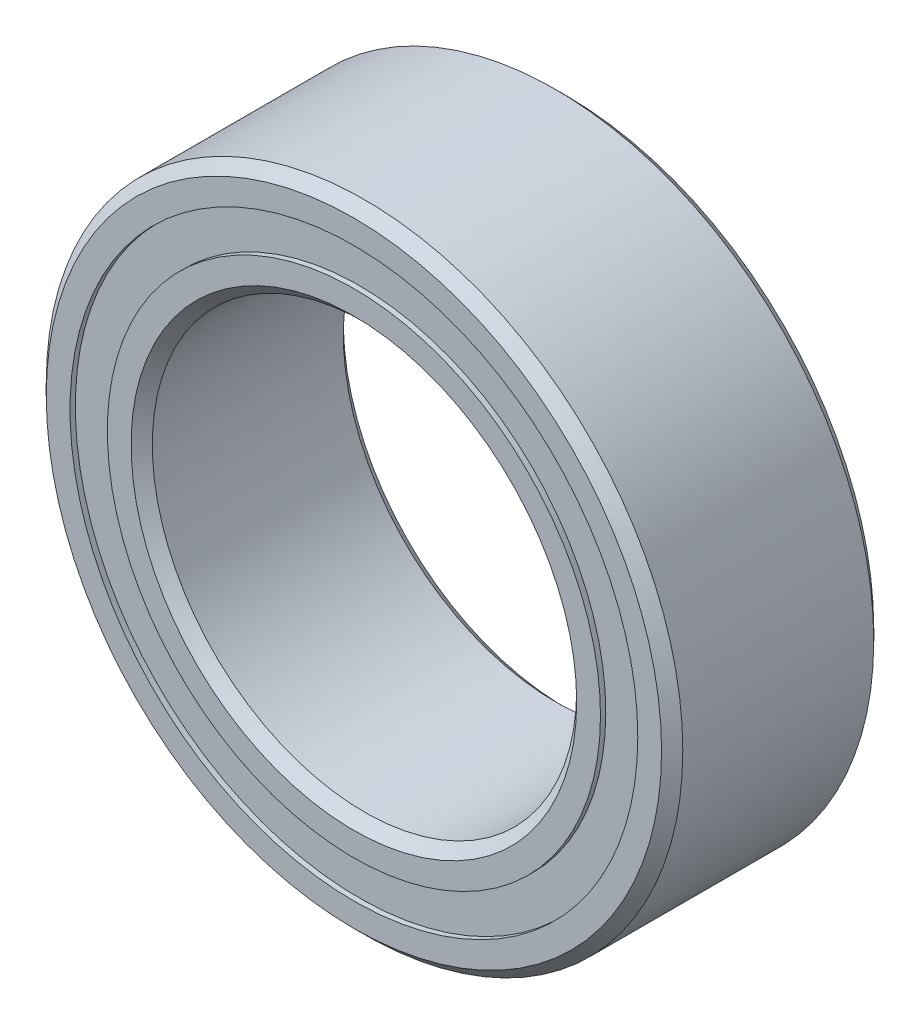
ISO-10303-21;
HEADER;
FILE_DESCRIPTION(('STEP AP214'),'2;1');
FILE_NAME('part.step','',(''),(''),'','','');
FILE_SCHEMA(('AUTOMOTIVE_DESIGN { 1 0 10303 214 1 1 1 1 }'));
ENDSEC;
DATA;
#1=APPLICATION_CONTEXT('core data for automotive mechanical design processes');
#2=APPLICATION_PROTOCOL_DEFINITION('international standard','automotive_design',2000,#1);
#3=PRODUCT_CONTEXT('',#1,'mechanical');
#4=PRODUCT('Part','Part','',(#3));
#5=PRODUCT_RELATED_PRODUCT_CATEGORY('part','',(#4));
#6=PRODUCT_DEFINITION_FORMATION('','',#4);
#7=PRODUCT_DEFINITION_CONTEXT('part definition',#1,'design');
#8=PRODUCT_DEFINITION('design','',#6,#7);
#9=PRODUCT_DEFINITION_SHAPE('','',#8);
#10=(LENGTH_UNIT() NAMED_UNIT(*) SI_UNIT(.MILLI.,.METRE.));
#11=(NAMED_UNIT(*) PLANE_ANGLE_UNIT() SI_UNIT($,.RADIAN.));
#12=(NAMED_UNIT(*) SI_UNIT($,.STERADIAN.) SOLID_ANGLE_UNIT());
#13=UNCERTAINTY_MEASURE_WITH_UNIT(LENGTH_MEASURE(1.E-05),#10,'distance_accuracy_value','');
#14=(GEOMETRIC_REPRESENTATION_CONTEXT(3) GLOBAL_UNCERTAINTY_ASSIGNED_CONTEXT((#13)) GLOBAL_UNIT_ASSIGNED_CONTEXT((#10,
#11,#12)) REPRESENTATION_CONTEXT('',''));
#15=CARTESIAN_POINT('',(0.,0.,0.));
#16=DIRECTION('',(0.,0.,1.));
#17=DIRECTION('',(1.,0.,0.));
#18=AXIS2_PLACEMENT_3D('',#15,#16,#17);
#19=CARTESIAN_POINT('',(-1.98437500000003,-3.43703832126947,0.));
#20=DIRECTION('',(-0.500000000000007,-0.866025403784435,0.));
#21=DIRECTION('',(0.,0.,-1.));
#22=AXIS2_PLACEMENT_3D('',#19,#20,#21);
#23=SPHERICAL_SURFACE('',#22,0.758760243513404);
#24=CARTESIAN_POINT('',(-2.36375512175674,-4.09414396753375,0.));
#25=VERTEX_POINT('',#24);
#26=VERTEX_LOOP('',#25);
#27=FACE_BOUND('',#26,.T.);
#28=CARTESIAN_POINT('',(-1.60499487824332,-2.7799326750052,0.));
#29=VERTEX_POINT('',#28);
#30=VERTEX_LOOP('',#29);
#31=FACE_BOUND('',#30,.T.);
#32=ADVANCED_FACE('P0_F16',(#27,#31),#23,.T.);
#33=CLOSED_SHELL('',(#32));
#34=MANIFOLD_SOLID_BREP('P0_B1',#33);
#35=CARTESIAN_POINT('',(-3.96875,0.,0.));
#36=DIRECTION('',(-1.,0.,0.));
#37=DIRECTION('',(0.,0.,-1.));
#38=AXIS2_PLACEMENT_3D('',#35,#36,#37);
#39=SPHERICAL_SURFACE('',#38,0.758760243513404);
#40=CARTESIAN_POINT('',(-4.7275102435134,0.,0.));
#41=VERTEX_POINT('',#40);
#42=VERTEX_LOOP('',#41);
#43=FACE_BOUND('',#42,.T.);
#44=CARTESIAN_POINT('',(-3.2099897564866,0.,0.));
#45=VERTEX_POINT('',#44);
#46=VERTEX_LOOP('',#45);
#47=FACE_BOUND('',#46,.T.);
#48=ADVANCED_FACE('P1_F16',(#43,#47),#39,.T.);
#49=CLOSED_SHELL('',(#48));
#50=MANIFOLD_SOLID_BREP('P1_B1',#49);
#51=CARTESIAN_POINT('',(3.43703832126948,-1.98437500000002,0.));
#52=DIRECTION('',(0.866025403784437,-0.500000000000004,0.));
#53=DIRECTION('',(0.,0.,-1.));
#54=AXIS2_PLACEMENT_3D('',#51,#52,#53);
#55=SPHERICAL_SURFACE('',#54,0.758760243513404);
#56=CARTESIAN_POINT('',(4.09414396753376,-2.36375512175672,0.));
#57=VERTEX_POINT('',#56);
#58=VERTEX_LOOP('',#57);
#59=FACE_BOUND('',#58,.T.);
#60=CARTESIAN_POINT('',(2.77993267500521,-1.60499487824331,0.));
#61=VERTEX_POINT('',#60);
#62=VERTEX_LOOP('',#61);
#63=FACE_BOUND('',#62,.T.);
#64=ADVANCED_FACE('P2_F17',(#59,#63),#55,.T.);
#65=CLOSED_SHELL('',(#64));
#66=MANIFOLD_SOLID_BREP('P2_B1',#65);
#67=CARTESIAN_POINT('',(1.98437499999998,-3.4370383212695,0.));
#68=DIRECTION('',(0.499999999999995,-0.866025403784442,0.));
#69=DIRECTION('',(0.,0.,-1.));
#70=AXIS2_PLACEMENT_3D('',#67,#68,#69);
#71=SPHERICAL_SURFACE('',#70,0.758760243513404);
#72=CARTESIAN_POINT('',(1.60499487824328,-2.77993267500523,0.));
#73=VERTEX_POINT('',#72);
#74=VERTEX_LOOP('',#73);
#75=FACE_BOUND('',#74,.T.);
#76=CARTESIAN_POINT('',(2.36375512175668,-4.09414396753378,0.));
#77=VERTEX_POINT('',#76);
#78=VERTEX_LOOP('',#77);
#79=FACE_BOUND('',#78,.T.);
#80=ADVANCED_FACE('P3_F16',(#75,#79),#71,.T.);
#81=CLOSED_SHELL('',(#80));
#82=MANIFOLD_SOLID_BREP('P3_B1',#81);
#83=CARTESIAN_POINT('',(1.984375,3.43703832126949,0.));
#84=DIRECTION('',(0.500000000000001,0.866025403784438,0.));
#85=DIRECTION('',(0.,0.,-1.));
#86=AXIS2_PLACEMENT_3D('',#83,#84,#85);
#87=SPHERICAL_SURFACE('',#86,0.758760243513404);
#88=CARTESIAN_POINT('',(2.36375512175671,4.09414396753376,0.));
#89=VERTEX_POINT('',#88);
#90=VERTEX_LOOP('',#89);
#91=FACE_BOUND('',#90,.T.);
#92=CARTESIAN_POINT('',(1.6049948782433,2.77993267500521,0.));
#93=VERTEX_POINT('',#92);
#94=VERTEX_LOOP('',#93);
#95=FACE_BOUND('',#94,.T.);
#96=ADVANCED_FACE('P4_F16',(#91,#95),#87,.T.);
#97=CLOSED_SHELL('',(#96));
#98=MANIFOLD_SOLID_BREP('P4_B1',#97);
#99=CARTESIAN_POINT('',(-1.98437499999996,3.43703832126952,0.));
#100=DIRECTION('',(-0.499999999999989,0.866025403784445,0.));
#101=DIRECTION('',(0.,0.,-1.));
#102=AXIS2_PLACEMENT_3D('',#99,#100,#101);
#103=SPHERICAL_SURFACE('',#102,0.758760243513404);
#104=CARTESIAN_POINT('',(-2.36375512175665,4.0941439675338,0.));
#105=VERTEX_POINT('',#104);
#106=VERTEX_LOOP('',#105);
#107=FACE_BOUND('',#106,.T.);
#108=CARTESIAN_POINT('',(-1.60499487824326,2.77993267500524,0.));
#109=VERTEX_POINT('',#108);
#110=VERTEX_LOOP('',#109);
#111=FACE_BOUND('',#110,.T.);
#112=ADVANCED_FACE('P5_F16',(#107,#111),#103,.T.);
#113=CLOSED_SHELL('',(#112));
#114=MANIFOLD_SOLID_BREP('P5_B1',#113);
#115=CARTESIAN_POINT('',(3.96875,0.,0.));
#116=DIRECTION('',(1.,0.,0.));
#117=DIRECTION('',(0.,0.,-1.));
#118=AXIS2_PLACEMENT_3D('',#115,#116,#117);
#119=SPHERICAL_SURFACE('',#118,0.758760243513404);
#120=CARTESIAN_POINT('',(3.2099897564866,0.,0.));
#121=VERTEX_POINT('',#120);
#122=VERTEX_LOOP('',#121);
#123=FACE_BOUND('',#122,.T.);
#124=CARTESIAN_POINT('',(4.7275102435134,0.,0.));
#125=VERTEX_POINT('',#124);
#126=VERTEX_LOOP('',#125);
#127=FACE_BOUND('',#126,.T.);
#128=ADVANCED_FACE('P6_F16',(#123,#127),#119,.T.);
#129=CLOSED_SHELL('',(#128));
#130=MANIFOLD_SOLID_BREP('P6_B1',#129);
#131=CARTESIAN_POINT('',(-3.43703832126947,1.98437500000004,0.));
#132=DIRECTION('',(-0.866025403784433,0.50000000000001,0.));
#133=DIRECTION('',(0.,0.,-1.));
#134=AXIS2_PLACEMENT_3D('',#131,#132,#133);
#135=SPHERICAL_SURFACE('',#134,0.758760243513404);
#136=CARTESIAN_POINT('',(-4.09414396753374,2.36375512175675,0.));
#137=VERTEX_POINT('',#136);
#138=VERTEX_LOOP('',#137);
#139=FACE_BOUND('',#138,.T.);
#140=CARTESIAN_POINT('',(-2.7799326750052,1.60499487824333,0.));
#141=VERTEX_POINT('',#140);
#142=VERTEX_LOOP('',#141);
#143=FACE_BOUND('',#142,.T.);
#144=ADVANCED_FACE('P7_F16',(#139,#143),#135,.T.);
#145=CLOSED_SHELL('',(#144));
#146=MANIFOLD_SOLID_BREP('P7_B1',#145);
#147=CARTESIAN_POINT('',(0.,4.24787087912088,-1.508125));
#148=DIRECTION('',(0.,0.,1.));
#149=DIRECTION('',(1.,0.,0.));
#150=AXIS2_PLACEMENT_3D('',#147,#148,#149);
#151=PLANE('',#150);
#152=CARTESIAN_POINT('',(0.,0.,-1.508125));
#153=DIRECTION('',(0.,0.,1.));
#154=DIRECTION('',(1.,0.,0.));
#155=AXIS2_PLACEMENT_3D('',#152,#153,#154);
#156=CIRCLE('',#155,3.68962912087912);
#157=CARTESIAN_POINT('',(3.68962912087912,0.,-1.508125));
#158=VERTEX_POINT('',#157);
#159=EDGE_CURVE('P8_E18',#158,#158,#156,.T.);
#160=ORIENTED_EDGE('',*,*,#159,.T.);
#161=EDGE_LOOP('',(#160));
#162=FACE_BOUND('',#161,.T.);
#163=CARTESIAN_POINT('',(0.,0.,-1.508125));
#164=DIRECTION('',(0.,0.,1.));
#165=DIRECTION('',(1.,0.,0.));
#166=AXIS2_PLACEMENT_3D('',#163,#164,#165);
#167=CIRCLE('',#166,4.24787087912088);
#168=CARTESIAN_POINT('',(4.24787087912088,0.,-1.508125));
#169=VERTEX_POINT('',#168);
#170=EDGE_CURVE('P8_E27',#169,#169,#167,.T.);
#171=ORIENTED_EDGE('',*,*,#170,.F.);
#172=EDGE_LOOP('',(#171));
#173=FACE_BOUND('',#172,.T.);
#174=ADVANCED_FACE('P8_F15',(#162,#173),#151,.F.);
#175=CARTESIAN_POINT('',(0.,0.,1.5875));
#176=DIRECTION('',(0.,0.,1.));
#177=DIRECTION('',(1.,0.,0.));
#178=AXIS2_PLACEMENT_3D('',#175,#176,#177);
#179=CYLINDRICAL_SURFACE('',#178,3.68962912087912);
#180=ORIENTED_EDGE('',*,*,#159,.F.);
#181=EDGE_LOOP('',(#180));
#182=FACE_BOUND('',#181,.T.);
#183=CARTESIAN_POINT('',(0.,0.,-0.758760243513405));
#184=DIRECTION('',(0.,0.,1.));
#185=DIRECTION('',(1.,0.,0.));
#186=AXIS2_PLACEMENT_3D('',#183,#184,#185);
#187=CIRCLE('',#186,3.68962912087912);
#188=CARTESIAN_POINT('',(3.68962912087912,0.,-0.758760243513405));
#189=VERTEX_POINT('',#188);
#190=EDGE_CURVE('P8_E22',#189,#189,#187,.T.);
#191=ORIENTED_EDGE('',*,*,#190,.T.);
#192=EDGE_LOOP('',(#191));
#193=FACE_BOUND('',#192,.T.);
#194=ADVANCED_FACE('P8_F37',(#182,#193),#179,.F.);
#195=CARTESIAN_POINT('',(0.,0.,1.5875));
#196=DIRECTION('',(0.,0.,1.));
#197=DIRECTION('',(1.,0.,0.));
#198=AXIS2_PLACEMENT_3D('',#195,#196,#197);
#199=CYLINDRICAL_SURFACE('',#198,4.24787087912088);
#200=CARTESIAN_POINT('',(0.,0.,-0.758760243513404));
#201=DIRECTION('',(0.,0.,1.));
#202=DIRECTION('',(1.,0.,0.));
#203=AXIS2_PLACEMENT_3D('',#200,#201,#202);
#204=CIRCLE('',#203,4.24787087912088);
#205=CARTESIAN_POINT('',(4.24787087912088,0.,-0.758760243513404));
#206=VERTEX_POINT('',#205);
#207=EDGE_CURVE('P8_E10',#206,#206,#204,.F.);
#208=ORIENTED_EDGE('',*,*,#207,.T.);
#209=EDGE_LOOP('',(#208));
#210=FACE_BOUND('',#209,.T.);
#211=ORIENTED_EDGE('',*,*,#170,.T.);
#212=EDGE_LOOP('',(#211));
#213=FACE_BOUND('',#212,.T.);
#214=ADVANCED_FACE('P8_F40',(#210,#213),#199,.T.);
#215=CARTESIAN_POINT('',(0.,4.24787087912088,-0.758760243513404));
#216=DIRECTION('',(0.,0.,-1.));
#217=DIRECTION('',(-1.,0.,0.));
#218=AXIS2_PLACEMENT_3D('',#215,#216,#217);
#219=PLANE('',#218);
#220=ORIENTED_EDGE('',*,*,#207,.F.);
#221=EDGE_LOOP('',(#220));
#222=FACE_BOUND('',#221,.T.);
#223=ORIENTED_EDGE('',*,*,#190,.F.);
#224=EDGE_LOOP('',(#223));
#225=FACE_BOUND('',#224,.T.);
#226=ADVANCED_FACE('P8_F43',(#222,#225),#219,.F.);
#227=CLOSED_SHELL('',(#174,#194,#214,#226));
#228=MANIFOLD_SOLID_BREP('P8_B1',#227);
#229=CARTESIAN_POINT('',(0.,0.,0.));
#230=DIRECTION('',(0.,0.,1.));
#231=DIRECTION('',(1.,0.,0.));
#232=AXIS2_PLACEMENT_3D('',#229,#230,#231);
#233=TOROIDAL_SURFACE('',#232,3.96875,0.758760243513403);
#234=CARTESIAN_POINT('',(0.,0.,0.705555555555556));
#235=DIRECTION('',(0.,0.,1.));
#236=DIRECTION('',(1.,0.,0.));
#237=AXIS2_PLACEMENT_3D('',#234,#235,#236);
#238=CIRCLE('',#237,3.68962912087912);
#239=CARTESIAN_POINT('',(3.68962912087912,0.,0.705555555555556));
#240=VERTEX_POINT('',#239);
#241=EDGE_CURVE('P9_E33',#240,#240,#238,.T.);
#242=ORIENTED_EDGE('',*,*,#241,.F.);
#243=EDGE_LOOP('',(#242));
#244=FACE_BOUND('',#243,.T.);
#245=CARTESIAN_POINT('',(0.,0.,-0.705555555555556));
#246=DIRECTION('',(0.,0.,1.));
#247=DIRECTION('',(1.,0.,0.));
#248=AXIS2_PLACEMENT_3D('',#245,#246,#247);
#249=CIRCLE('',#248,3.68962912087912);
#250=CARTESIAN_POINT('',(3.68962912087912,0.,-0.705555555555556));
#251=VERTEX_POINT('',#250);
#252=EDGE_CURVE('P9_E31',#251,#251,#249,.F.);
#253=ORIENTED_EDGE('',*,*,#252,.F.);
#254=EDGE_LOOP('',(#253));
#255=FACE_BOUND('',#254,.T.);
#256=ADVANCED_FACE('P9_F15',(#244,#255),#233,.F.);
#257=CARTESIAN_POINT('',(0.,0.,1.5875));
#258=DIRECTION('',(0.,0.,1.));
#259=DIRECTION('',(1.,0.,0.));
#260=AXIS2_PLACEMENT_3D('',#257,#258,#259);
#261=CYLINDRICAL_SURFACE('',#260,3.68962912087912);
#262=CARTESIAN_POINT('',(0.,0.,1.5875));
#263=DIRECTION('',(0.,0.,1.));
#264=DIRECTION('',(1.,0.,0.));
#265=AXIS2_PLACEMENT_3D('',#262,#263,#264);
#266=CIRCLE('',#265,3.68962912087912);
#267=CARTESIAN_POINT('',(3.68962912087912,0.,1.5875));
#268=VERTEX_POINT('',#267);
#269=EDGE_CURVE('P9_E19',#268,#268,#266,.F.);
#270=ORIENTED_EDGE('',*,*,#269,.T.);
#271=EDGE_LOOP('',(#270));
#272=FACE_BOUND('',#271,.T.);
#273=ORIENTED_EDGE('',*,*,#241,.T.);
#274=EDGE_LOOP('',(#273));
#275=FACE_BOUND('',#274,.T.);
#276=ADVANCED_FACE('P9_F49',(#272,#275),#261,.T.);
#277=CARTESIAN_POINT('',(0.,0.,1.5875));
#278=DIRECTION('',(0.,0.,1.));
#279=DIRECTION('',(1.,0.,0.));
#280=AXIS2_PLACEMENT_3D('',#277,#278,#279);
#281=CYLINDRICAL_SURFACE('',#280,3.68962912087912);
#282=ORIENTED_EDGE('',*,*,#252,.T.);
#283=EDGE_LOOP('',(#282));
#284=FACE_BOUND('',#283,.T.);
#285=CARTESIAN_POINT('',(0.,0.,-1.5875));
#286=DIRECTION('',(0.,0.,1.));
#287=DIRECTION('',(1.,0.,0.));
#288=AXIS2_PLACEMENT_3D('',#285,#286,#287);
#289=CIRCLE('',#288,3.68962912087912);
#290=CARTESIAN_POINT('',(3.68962912087912,0.,-1.5875));
#291=VERTEX_POINT('',#290);
#292=EDGE_CURVE('P9_E42',#291,#291,#289,.T.);
#293=ORIENTED_EDGE('',*,*,#292,.T.);
#294=EDGE_LOOP('',(#293));
#295=FACE_BOUND('',#294,.T.);
#296=ADVANCED_FACE('P9_F56',(#284,#295),#281,.T.);
#297=CARTESIAN_POINT('',(0.,3.68962912087912,1.5875));
#298=DIRECTION('',(0.,0.,-1.));
#299=DIRECTION('',(-1.,0.,0.));
#300=AXIS2_PLACEMENT_3D('',#297,#298,#299);
#301=PLANE('',#300);
#302=ORIENTED_EDGE('',*,*,#269,.F.);
#303=EDGE_LOOP('',(#302));
#304=FACE_BOUND('',#303,.T.);
#305=CARTESIAN_POINT('',(0.,0.,1.58749999997099));
#306=DIRECTION('',(0.,0.,1.));
#307=DIRECTION('',(1.,0.,0.));
#308=AXIS2_PLACEMENT_3D('',#305,#306,#307);
#309=CIRCLE('',#308,3.33374999996749);
#310=CARTESIAN_POINT('',(3.33374999996749,0.,1.58749999997099));
#311=VERTEX_POINT('',#310);
#312=EDGE_CURVE('P9_E40',#311,#311,#309,.F.);
#313=ORIENTED_EDGE('',*,*,#312,.T.);
#314=EDGE_LOOP('',(#313));
#315=FACE_BOUND('',#314,.T.);
#316=ADVANCED_FACE('P9_F52',(#304,#315),#301,.F.);
#317=CARTESIAN_POINT('',(0.,3.33375,-1.5875));
#318=DIRECTION('',(0.,0.,1.));
#319=DIRECTION('',(1.,0.,0.));
#320=AXIS2_PLACEMENT_3D('',#317,#318,#319);
#321=PLANE('',#320);
#322=CARTESIAN_POINT('',(0.,0.,-1.58749999997099));
#323=DIRECTION('',(0.,0.,-1.));
#324=DIRECTION('',(0.,1.,0.));
#325=AXIS2_PLACEMENT_3D('',#322,#323,#324);
#326=CIRCLE('',#325,3.33375000002434);
#327=CARTESIAN_POINT('',(0.,3.33375000002434,-1.58749999997099));
#328=VERTEX_POINT('',#327);
#329=EDGE_CURVE('P9_E28',#328,#328,#326,.F.);
#330=ORIENTED_EDGE('',*,*,#329,.T.);
#331=EDGE_LOOP('',(#330));
#332=FACE_BOUND('',#331,.T.);
#333=ORIENTED_EDGE('',*,*,#292,.F.);
#334=EDGE_LOOP('',(#333));
#335=FACE_BOUND('',#334,.T.);
#336=ADVANCED_FACE('P9_F55',(#332,#335),#321,.F.);
#337=CARTESIAN_POINT('',(0.,0.,1.58749999991414));
#338=DIRECTION('',(0.,0.,1.));
#339=DIRECTION('',(1.,0.,0.));
#340=AXIS2_PLACEMENT_3D('',#337,#338,#339);
#341=CONICAL_SURFACE('',#340,3.33374999991065,0.785398163397448);
#342=ORIENTED_EDGE('',*,*,#312,.F.);
#343=EDGE_LOOP('',(#342));
#344=FACE_BOUND('',#343,.T.);
#345=CARTESIAN_POINT('',(0.,0.,1.42875));
#346=DIRECTION('',(0.,0.,1.));
#347=DIRECTION('',(1.,0.,0.));
#348=AXIS2_PLACEMENT_3D('',#345,#346,#347);
#349=CIRCLE('',#348,3.175);
#350=CARTESIAN_POINT('',(3.175,0.,1.42875));
#351=VERTEX_POINT('',#350);
#352=EDGE_CURVE('P9_E23',#351,#351,#349,.F.);
#353=ORIENTED_EDGE('',*,*,#352,.T.);
#354=EDGE_LOOP('',(#353));
#355=FACE_BOUND('',#354,.T.);
#356=ADVANCED_FACE('P9_F60',(#344,#355),#341,.F.);
#357=CARTESIAN_POINT('',(0.,0.,-1.58749999997099));
#358=DIRECTION('',(0.,0.,-1.));
#359=DIRECTION('',(0.,1.,0.));
#360=AXIS2_PLACEMENT_3D('',#357,#358,#359);
#361=CONICAL_SURFACE('',#360,3.33375000002434,0.785398163397448);
#362=ORIENTED_EDGE('',*,*,#329,.F.);
#363=EDGE_LOOP('',(#362));
#364=FACE_BOUND('',#363,.T.);
#365=CARTESIAN_POINT('',(0.,0.,-1.42875));
#366=DIRECTION('',(0.,0.,1.));
#367=DIRECTION('',(1.,0.,0.));
#368=AXIS2_PLACEMENT_3D('',#365,#366,#367);
#369=CIRCLE('',#368,3.175);
#370=CARTESIAN_POINT('',(3.175,0.,-1.42875));
#371=VERTEX_POINT('',#370);
#372=EDGE_CURVE('P9_E10',#371,#371,#369,.T.);
#373=ORIENTED_EDGE('',*,*,#372,.T.);
#374=EDGE_LOOP('',(#373));
#375=FACE_BOUND('',#374,.T.);
#376=ADVANCED_FACE('P9_F63',(#364,#375),#361,.F.);
#377=CARTESIAN_POINT('',(0.,0.,1.5875));
#378=DIRECTION('',(0.,0.,1.));
#379=DIRECTION('',(1.,0.,0.));
#380=AXIS2_PLACEMENT_3D('',#377,#378,#379);
#381=CYLINDRICAL_SURFACE('',#380,3.175);
#382=ORIENTED_EDGE('',*,*,#352,.F.);
#383=EDGE_LOOP('',(#382));
#384=FACE_BOUND('',#383,.T.);
#385=ORIENTED_EDGE('',*,*,#372,.F.);
#386=EDGE_LOOP('',(#385));
#387=FACE_BOUND('',#386,.T.);
#388=ADVANCED_FACE('P9_F67',(#384,#387),#381,.F.);
#389=CLOSED_SHELL('',(#256,#276,#296,#316,#336,#356,#376,#388));
#390=MANIFOLD_SOLID_BREP('P9_B1',#389);
#391=CARTESIAN_POINT('',(0.,4.24787087912088,0.758760243513404));
#392=DIRECTION('',(0.,0.,1.));
#393=DIRECTION('',(1.,0.,0.));
#394=AXIS2_PLACEMENT_3D('',#391,#392,#393);
#395=PLANE('',#394);
#396=CARTESIAN_POINT('',(0.,0.,0.758760243513404));
#397=DIRECTION('',(0.,0.,1.));
#398=DIRECTION('',(1.,0.,0.));
#399=AXIS2_PLACEMENT_3D('',#396,#397,#398);
#400=CIRCLE('',#399,3.68962912087912);
#401=CARTESIAN_POINT('',(3.68962912087912,0.,0.758760243513404));
#402=VERTEX_POINT('',#401);
#403=EDGE_CURVE('P10_E18',#402,#402,#400,.T.);
#404=ORIENTED_EDGE('',*,*,#403,.T.);
#405=EDGE_LOOP('',(#404));
#406=FACE_BOUND('',#405,.T.);
#407=CARTESIAN_POINT('',(0.,0.,0.758760243513404));
#408=DIRECTION('',(0.,0.,1.));
#409=DIRECTION('',(1.,0.,0.));
#410=AXIS2_PLACEMENT_3D('',#407,#408,#409);
#411=CIRCLE('',#410,4.24787087912088);
#412=CARTESIAN_POINT('',(4.24787087912088,0.,0.758760243513404));
#413=VERTEX_POINT('',#412);
#414=EDGE_CURVE('P10_E27',#413,#413,#411,.T.);
#415=ORIENTED_EDGE('',*,*,#414,.F.);
#416=EDGE_LOOP('',(#415));
#417=FACE_BOUND('',#416,.T.);
#418=ADVANCED_FACE('P10_F15',(#406,#417),#395,.F.);
#419=CARTESIAN_POINT('',(0.,0.,1.5875));
#420=DIRECTION('',(0.,0.,1.));
#421=DIRECTION('',(1.,0.,0.));
#422=AXIS2_PLACEMENT_3D('',#419,#420,#421);
#423=CYLINDRICAL_SURFACE('',#422,3.68962912087912);
#424=ORIENTED_EDGE('',*,*,#403,.F.);
#425=EDGE_LOOP('',(#424));
#426=FACE_BOUND('',#425,.T.);
#427=CARTESIAN_POINT('',(0.,0.,1.508125));
#428=DIRECTION('',(0.,0.,1.));
#429=DIRECTION('',(1.,0.,0.));
#430=AXIS2_PLACEMENT_3D('',#427,#428,#429);
#431=CIRCLE('',#430,3.68962912087912);
#432=CARTESIAN_POINT('',(3.68962912087912,0.,1.508125));
#433=VERTEX_POINT('',#432);
#434=EDGE_CURVE('P10_E22',#433,#433,#431,.T.);
#435=ORIENTED_EDGE('',*,*,#434,.T.);
#436=EDGE_LOOP('',(#435));
#437=FACE_BOUND('',#436,.T.);
#438=ADVANCED_FACE('P10_F37',(#426,#437),#423,.F.);
#439=CARTESIAN_POINT('',(0.,0.,1.5875));
#440=DIRECTION('',(0.,0.,1.));
#441=DIRECTION('',(1.,0.,0.));
#442=AXIS2_PLACEMENT_3D('',#439,#440,#441);
#443=CYLINDRICAL_SURFACE('',#442,4.24787087912088);
#444=CARTESIAN_POINT('',(0.,0.,1.508125));
#445=DIRECTION('',(0.,0.,1.));
#446=DIRECTION('',(1.,0.,0.));
#447=AXIS2_PLACEMENT_3D('',#444,#445,#446);
#448=CIRCLE('',#447,4.24787087912088);
#449=CARTESIAN_POINT('',(4.24787087912088,0.,1.508125));
#450=VERTEX_POINT('',#449);
#451=EDGE_CURVE('P10_E10',#450,#450,#448,.F.);
#452=ORIENTED_EDGE('',*,*,#451,.T.);
#453=EDGE_LOOP('',(#452));
#454=FACE_BOUND('',#453,.T.);
#455=ORIENTED_EDGE('',*,*,#414,.T.);
#456=EDGE_LOOP('',(#455));
#457=FACE_BOUND('',#456,.T.);
#458=ADVANCED_FACE('P10_F40',(#454,#457),#443,.T.);
#459=CARTESIAN_POINT('',(0.,4.24787087912088,1.508125));
#460=DIRECTION('',(0.,0.,-1.));
#461=DIRECTION('',(-1.,0.,0.));
#462=AXIS2_PLACEMENT_3D('',#459,#460,#461);
#463=PLANE('',#462);
#464=ORIENTED_EDGE('',*,*,#451,.F.);
#465=EDGE_LOOP('',(#464));
#466=FACE_BOUND('',#465,.T.);
#467=ORIENTED_EDGE('',*,*,#434,.F.);
#468=EDGE_LOOP('',(#467));
#469=FACE_BOUND('',#468,.T.);
#470=ADVANCED_FACE('P10_F43',(#466,#469),#463,.F.);
#471=CLOSED_SHELL('',(#418,#438,#458,#470));
#472=MANIFOLD_SOLID_BREP('P10_B1',#471);
#473=CARTESIAN_POINT('',(-3.43703832126951,-1.98437499999997,0.));
#474=DIRECTION('',(-0.866025403784443,-0.499999999999992,0.));
#475=DIRECTION('',(0.,0.,-1.));
#476=AXIS2_PLACEMENT_3D('',#473,#474,#475);
#477=SPHERICAL_SURFACE('',#476,0.758760243513404);
#478=CARTESIAN_POINT('',(-4.09414396753379,-2.36375512175666,0.));
#479=VERTEX_POINT('',#478);
#480=VERTEX_LOOP('',#479);
#481=FACE_BOUND('',#480,.T.);
#482=CARTESIAN_POINT('',(-2.77993267500523,-1.60499487824327,0.));
#483=VERTEX_POINT('',#482);
#484=VERTEX_LOOP('',#483);
#485=FACE_BOUND('',#484,.T.);
#486=ADVANCED_FACE('P11_F16',(#481,#485),#477,.T.);
#487=CLOSED_SHELL('',(#486));
#488=MANIFOLD_SOLID_BREP('P11_B1',#487);
#489=CARTESIAN_POINT('',(0.,0.,0.));
#490=DIRECTION('',(0.,0.,1.));
#491=DIRECTION('',(1.,0.,0.));
#492=AXIS2_PLACEMENT_3D('',#489,#490,#491);
#493=TOROIDAL_SURFACE('',#492,3.96875,0.758760243513404);
#494=CARTESIAN_POINT('',(0.,0.,-0.705555555555556));
#495=DIRECTION('',(0.,0.,1.));
#496=DIRECTION('',(1.,0.,0.));
#497=AXIS2_PLACEMENT_3D('',#494,#495,#496);
#498=CIRCLE('',#497,4.24787087912088);
#499=CARTESIAN_POINT('',(4.24787087912088,0.,-0.705555555555556));
#500=VERTEX_POINT('',#499);
#501=EDGE_CURVE('P12_E33',#500,#500,#498,.F.);
#502=ORIENTED_EDGE('',*,*,#501,.T.);
#503=EDGE_LOOP('',(#502));
#504=FACE_BOUND('',#503,.T.);
#505=CARTESIAN_POINT('',(0.,0.,0.705555555555555));
#506=DIRECTION('',(0.,0.,1.));
#507=DIRECTION('',(1.,0.,0.));
#508=AXIS2_PLACEMENT_3D('',#505,#506,#507);
#509=CIRCLE('',#508,4.24787087912088);
#510=CARTESIAN_POINT('',(4.24787087912088,0.,0.705555555555555));
#511=VERTEX_POINT('',#510);
#512=EDGE_CURVE('P12_E31',#511,#511,#509,.T.);
#513=ORIENTED_EDGE('',*,*,#512,.T.);
#514=EDGE_LOOP('',(#513));
#515=FACE_BOUND('',#514,.T.);
#516=ADVANCED_FACE('P12_F15',(#504,#515),#493,.F.);
#517=CARTESIAN_POINT('',(0.,0.,1.5875));
#518=DIRECTION('',(0.,0.,1.));
#519=DIRECTION('',(1.,0.,0.));
#520=AXIS2_PLACEMENT_3D('',#517,#518,#519);
#521=CYLINDRICAL_SURFACE('',#520,4.24787087912088);
#522=CARTESIAN_POINT('',(0.,0.,-1.5875));
#523=DIRECTION('',(0.,0.,1.));
#524=DIRECTION('',(1.,0.,0.));
#525=AXIS2_PLACEMENT_3D('',#522,#523,#524);
#526=CIRCLE('',#525,4.24787087912088);
#527=CARTESIAN_POINT('',(4.24787087912088,0.,-1.5875));
#528=VERTEX_POINT('',#527);
#529=EDGE_CURVE('P12_E19',#528,#528,#526,.F.);
#530=ORIENTED_EDGE('',*,*,#529,.T.);
#531=EDGE_LOOP('',(#530));
#532=FACE_BOUND('',#531,.T.);
#533=ORIENTED_EDGE('',*,*,#501,.F.);
#534=EDGE_LOOP('',(#533));
#535=FACE_BOUND('',#534,.T.);
#536=ADVANCED_FACE('P12_F49',(#532,#535),#521,.F.);
#537=CARTESIAN_POINT('',(0.,0.,1.5875));
#538=DIRECTION('',(0.,0.,1.));
#539=DIRECTION('',(1.,0.,0.));
#540=AXIS2_PLACEMENT_3D('',#537,#538,#539);
#541=CYLINDRICAL_SURFACE('',#540,4.24787087912088);
#542=ORIENTED_EDGE('',*,*,#512,.F.);
#543=EDGE_LOOP('',(#542));
#544=FACE_BOUND('',#543,.T.);
#545=CARTESIAN_POINT('',(0.,0.,1.5875));
#546=DIRECTION('',(0.,0.,1.));
#547=DIRECTION('',(1.,0.,0.));
#548=AXIS2_PLACEMENT_3D('',#545,#546,#547);
#549=CIRCLE('',#548,4.24787087912088);
#550=CARTESIAN_POINT('',(4.24787087912088,0.,1.5875));
#551=VERTEX_POINT('',#550);
#552=EDGE_CURVE('P12_E42',#551,#551,#549,.T.);
#553=ORIENTED_EDGE('',*,*,#552,.T.);
#554=EDGE_LOOP('',(#553));
#555=FACE_BOUND('',#554,.T.);
#556=ADVANCED_FACE('P12_F56',(#544,#555),#541,.F.);
#557=CARTESIAN_POINT('',(0.,4.60375,-1.5875));
#558=DIRECTION('',(0.,0.,1.));
#559=DIRECTION('',(1.,0.,0.));
#560=AXIS2_PLACEMENT_3D('',#557,#558,#559);
#561=PLANE('',#560);
#562=ORIENTED_EDGE('',*,*,#529,.F.);
#563=EDGE_LOOP('',(#562));
#564=FACE_BOUND('',#563,.T.);
#565=CARTESIAN_POINT('',(0.,0.,-1.58750000008467));
#566=DIRECTION('',(0.,0.,1.));
#567=DIRECTION('',(1.,0.,0.));
#568=AXIS2_PLACEMENT_3D('',#565,#566,#567);
#569=CIRCLE('',#568,4.60375000000113);
#570=CARTESIAN_POINT('',(4.60375000000113,0.,-1.58750000008467));
#571=VERTEX_POINT('',#570);
#572=EDGE_CURVE('P12_E40',#571,#571,#569,.T.);
#573=ORIENTED_EDGE('',*,*,#572,.F.);
#574=EDGE_LOOP('',(#573));
#575=FACE_BOUND('',#574,.T.);
#576=ADVANCED_FACE('P12_F52',(#564,#575),#561,.F.);
#577=CARTESIAN_POINT('',(0.,4.60375,1.5875));
#578=DIRECTION('',(0.,0.,-1.));
#579=DIRECTION('',(-1.,0.,0.));
#580=AXIS2_PLACEMENT_3D('',#577,#578,#579);
#581=PLANE('',#580);
#582=CARTESIAN_POINT('',(0.,0.,1.58750000008467));
#583=DIRECTION('',(0.,0.,-1.));
#584=DIRECTION('',(-1.,0.,0.));
#585=AXIS2_PLACEMENT_3D('',#582,#583,#584);
#586=CIRCLE('',#585,4.60375000000113);
#587=CARTESIAN_POINT('',(-4.60375000000113,0.,1.58750000008467));
#588=VERTEX_POINT('',#587);
#589=EDGE_CURVE('P12_E28',#588,#588,#586,.T.);
#590=ORIENTED_EDGE('',*,*,#589,.F.);
#591=EDGE_LOOP('',(#590));
#592=FACE_BOUND('',#591,.T.);
#593=ORIENTED_EDGE('',*,*,#552,.F.);
#594=EDGE_LOOP('',(#593));
#595=FACE_BOUND('',#594,.T.);
#596=ADVANCED_FACE('P12_F55',(#592,#595),#581,.F.);
#597=CARTESIAN_POINT('',(0.,0.,-1.42875000000231));
#598=DIRECTION('',(0.,0.,1.));
#599=DIRECTION('',(1.,0.,0.));
#600=AXIS2_PLACEMENT_3D('',#597,#598,#599);
#601=CONICAL_SURFACE('',#600,4.76250000002665,0.785398163218414);
#602=CARTESIAN_POINT('',(0.,0.,-1.42875));
#603=DIRECTION('',(0.,0.,1.));
#604=DIRECTION('',(1.,0.,0.));
#605=AXIS2_PLACEMENT_3D('',#602,#603,#604);
#606=CIRCLE('',#605,4.7625);
#607=CARTESIAN_POINT('',(4.7625,0.,-1.42875));
#608=VERTEX_POINT('',#607);
#609=EDGE_CURVE('P12_E23',#608,#608,#606,.T.);
#610=ORIENTED_EDGE('',*,*,#609,.F.);
#611=EDGE_LOOP('',(#610));
#612=FACE_BOUND('',#611,.T.);
#613=ORIENTED_EDGE('',*,*,#572,.T.);
#614=EDGE_LOOP('',(#613));
#615=FACE_BOUND('',#614,.T.);
#616=ADVANCED_FACE('P12_F60',(#612,#615),#601,.T.);
#617=CARTESIAN_POINT('',(0.,0.,1.42875000005915));
#618=DIRECTION('',(0.,0.,-1.));
#619=DIRECTION('',(-1.,0.,0.));
#620=AXIS2_PLACEMENT_3D('',#617,#618,#619);
#621=CONICAL_SURFACE('',#620,4.7624999999698,0.785398163218414);
#622=CARTESIAN_POINT('',(0.,0.,1.42875));
#623=DIRECTION('',(0.,0.,1.));
#624=DIRECTION('',(1.,0.,0.));
#625=AXIS2_PLACEMENT_3D('',#622,#623,#624);
#626=CIRCLE('',#625,4.7625);
#627=CARTESIAN_POINT('',(4.7625,0.,1.42875));
#628=VERTEX_POINT('',#627);
#629=EDGE_CURVE('P12_E10',#628,#628,#626,.F.);
#630=ORIENTED_EDGE('',*,*,#629,.F.);
#631=EDGE_LOOP('',(#630));
#632=FACE_BOUND('',#631,.T.);
#633=ORIENTED_EDGE('',*,*,#589,.T.);
#634=EDGE_LOOP('',(#633));
#635=FACE_BOUND('',#634,.T.);
#636=ADVANCED_FACE('P12_F62',(#632,#635),#621,.T.);
#637=CARTESIAN_POINT('',(0.,0.,1.5875));
#638=DIRECTION('',(0.,0.,1.));
#639=DIRECTION('',(1.,0.,0.));
#640=AXIS2_PLACEMENT_3D('',#637,#638,#639);
#641=CYLINDRICAL_SURFACE('',#640,4.7625);
#642=ORIENTED_EDGE('',*,*,#629,.T.);
#643=EDGE_LOOP('',(#642));
#644=FACE_BOUND('',#643,.T.);
#645=ORIENTED_EDGE('',*,*,#609,.T.);
#646=EDGE_LOOP('',(#645));
#647=FACE_BOUND('',#646,.T.);
#648=ADVANCED_FACE('P12_F70',(#644,#647),#641,.T.);
#649=CLOSED_SHELL('',(#516,#536,#556,#576,#596,#616,#636,#648));
#650=MANIFOLD_SOLID_BREP('P12_B1',#649);
#651=CARTESIAN_POINT('',(0.,-3.96875,0.));
#652=DIRECTION('',(0.,-1.,0.));
#653=DIRECTION('',(0.,0.,-1.));
#654=AXIS2_PLACEMENT_3D('',#651,#652,#653);
#655=SPHERICAL_SURFACE('',#654,0.758760243513404);
#656=CARTESIAN_POINT('',(0.,-3.2099897564866,0.));
#657=VERTEX_POINT('',#656);
#658=VERTEX_LOOP('',#657);
#659=FACE_BOUND('',#658,.T.);
#660=CARTESIAN_POINT('',(0.,-4.7275102435134,0.));
#661=VERTEX_POINT('',#660);
#662=VERTEX_LOOP('',#661);
#663=FACE_BOUND('',#662,.T.);
#664=ADVANCED_FACE('P13_F16',(#659,#663),#655,.T.);
#665=CLOSED_SHELL('',(#664));
#666=MANIFOLD_SOLID_BREP('P13_B1',#665);
#667=CARTESIAN_POINT('',(3.4370383212695,1.98437499999999,0.));
#668=DIRECTION('',(0.86602540378444,0.499999999999998,0.));
#669=DIRECTION('',(0.,0.,-1.));
#670=AXIS2_PLACEMENT_3D('',#667,#668,#669);
#671=SPHERICAL_SURFACE('',#670,0.758760243513404);
#672=CARTESIAN_POINT('',(4.09414396753377,2.36375512175669,0.));
#673=VERTEX_POINT('',#672);
#674=VERTEX_LOOP('',#673);
#675=FACE_BOUND('',#674,.T.);
#676=CARTESIAN_POINT('',(2.77993267500522,1.60499487824329,0.));
#677=VERTEX_POINT('',#676);
#678=VERTEX_LOOP('',#677);
#679=FACE_BOUND('',#678,.T.);
#680=ADVANCED_FACE('P14_F16',(#675,#679),#671,.T.);
#681=CLOSED_SHELL('',(#680));
#682=MANIFOLD_SOLID_BREP('P14_B1',#681);
#683=CARTESIAN_POINT('',(0.,3.96875,0.));
#684=DIRECTION('',(0.,1.,0.));
#685=DIRECTION('',(0.,0.,-1.));
#686=AXIS2_PLACEMENT_3D('',#683,#684,#685);
#687=SPHERICAL_SURFACE('',#686,0.758760243513404);
#688=CARTESIAN_POINT('',(0.,3.2099897564866,0.));
#689=VERTEX_POINT('',#688);
#690=VERTEX_LOOP('',#689);
#691=FACE_BOUND('',#690,.T.);
#692=CARTESIAN_POINT('',(0.,4.7275102435134,0.));
#693=VERTEX_POINT('',#692);
#694=VERTEX_LOOP('',#693);
#695=FACE_BOUND('',#694,.T.);
#696=ADVANCED_FACE('P15_F16',(#691,#695),#687,.T.);
#697=CLOSED_SHELL('',(#696));
#698=MANIFOLD_SOLID_BREP('P15_B1',#697);
#699=ADVANCED_BREP_SHAPE_REPRESENTATION('',(#18,#34,#50,#66,#82,#98,#114,#130,#146,#228,#390,
#472,#488,#650,#666,#682,#698),#14);
#700=SHAPE_DEFINITION_REPRESENTATION(#9,#699);
ENDSEC;
END-ISO-10303-21;
